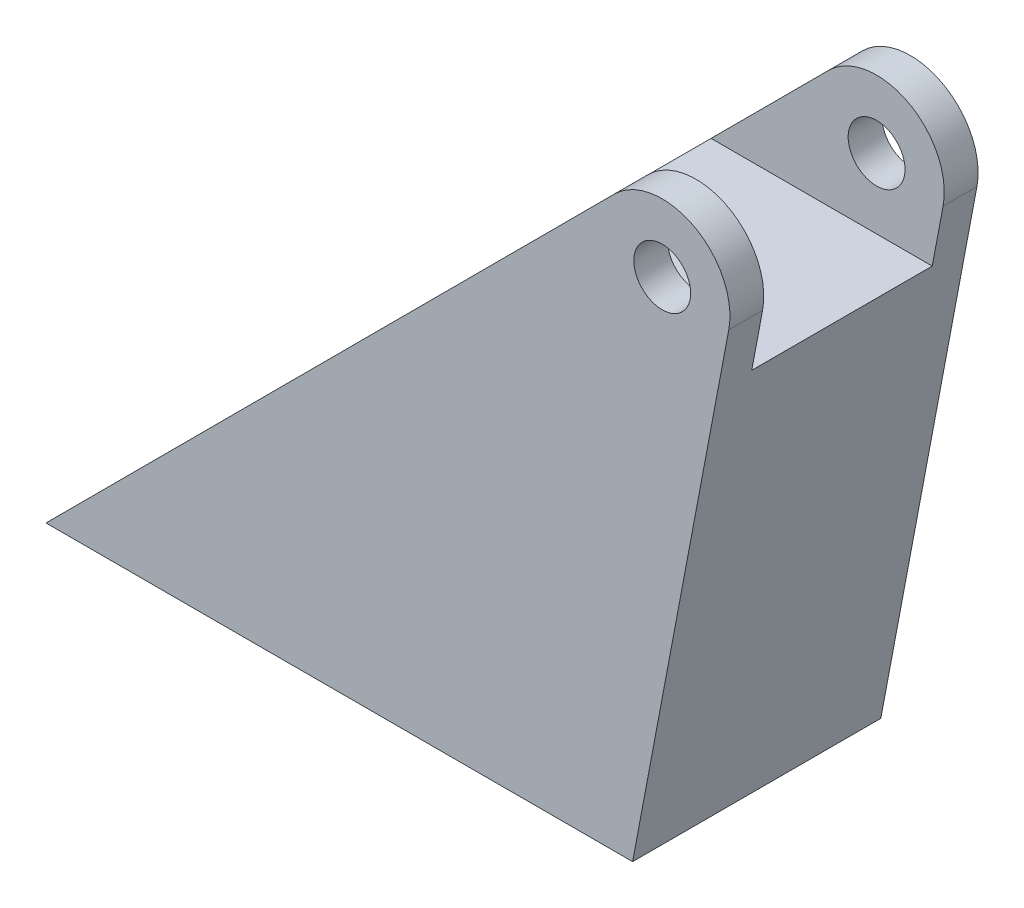
ISO-10303-21;
HEADER;
FILE_DESCRIPTION(('STEP AP214'),'2;1');
FILE_NAME('part.step','',(''),(''),'','','');
FILE_SCHEMA(('AUTOMOTIVE_DESIGN { 1 0 10303 214 1 1 1 1 }'));
ENDSEC;
DATA;
#1=APPLICATION_CONTEXT('core data for automotive mechanical design processes');
#2=APPLICATION_PROTOCOL_DEFINITION('international standard','automotive_design',2000,#1);
#3=PRODUCT_CONTEXT('',#1,'mechanical');
#4=PRODUCT('Part','Part','',(#3));
#5=PRODUCT_RELATED_PRODUCT_CATEGORY('part','',(#4));
#6=PRODUCT_DEFINITION_FORMATION('','',#4);
#7=PRODUCT_DEFINITION_CONTEXT('part definition',#1,'design');
#8=PRODUCT_DEFINITION('design','',#6,#7);
#9=PRODUCT_DEFINITION_SHAPE('','',#8);
#10=(LENGTH_UNIT() NAMED_UNIT(*) SI_UNIT(.MILLI.,.METRE.));
#11=(NAMED_UNIT(*) PLANE_ANGLE_UNIT() SI_UNIT($,.RADIAN.));
#12=(NAMED_UNIT(*) SI_UNIT($,.STERADIAN.) SOLID_ANGLE_UNIT());
#13=UNCERTAINTY_MEASURE_WITH_UNIT(LENGTH_MEASURE(1.E-05),#10,'distance_accuracy_value','');
#14=(GEOMETRIC_REPRESENTATION_CONTEXT(3) GLOBAL_UNCERTAINTY_ASSIGNED_CONTEXT((#13)) GLOBAL_UNIT_ASSIGNED_CONTEXT((#10,
#11,#12)) REPRESENTATION_CONTEXT('',''));
#15=CARTESIAN_POINT('',(0.,0.,0.));
#16=DIRECTION('',(0.,0.,1.));
#17=DIRECTION('',(1.,0.,0.));
#18=AXIS2_PLACEMENT_3D('',#15,#16,#17);
#19=CARTESIAN_POINT('',(4.16611869461281,92.3902344014633,0.));
#20=DIRECTION('',(0.,0.,1.));
#21=DIRECTION('',(1.,0.,0.));
#22=AXIS2_PLACEMENT_3D('',#19,#20,#21);
#23=PLANE('',#22);
#24=CARTESIAN_POINT('',(4.16611869461281,92.3902344014633,0.));
#25=DIRECTION('',(0.,0.,1.));
#26=DIRECTION('',(1.,0.,0.));
#27=AXIS2_PLACEMENT_3D('',#24,#25,#26);
#28=CIRCLE('',#27,4.00000000000001);
#29=CARTESIAN_POINT('',(8.16611869461282,92.3902344014633,0.));
#30=VERTEX_POINT('',#29);
#31=EDGE_CURVE('E93',#30,#30,#28,.T.);
#32=ORIENTED_EDGE('',*,*,#31,.T.);
#33=EDGE_LOOP('',(#32));
#34=FACE_BOUND('',#33,.T.);
#35=DIRECTION('',(1.,0.,0.));
#36=VECTOR('',#35,1.);
#37=CARTESIAN_POINT('',(-82.55,19.05,0.));
#38=LINE('',#37,#36);
#39=CARTESIAN_POINT('',(-82.55,19.05,0.));
#40=VERTEX_POINT('',#39);
#41=CARTESIAN_POINT('',(0.,19.05,0.));
#42=VERTEX_POINT('',#41);
#43=EDGE_CURVE('E105',#40,#42,#38,.T.);
#44=ORIENTED_EDGE('',*,*,#43,.F.);
#45=DIRECTION('',(-0.70668916022688,-0.707524155642637,0.));
#46=VECTOR('',#45,1.);
#47=CARTESIAN_POINT('',(-82.55,19.05,0.));
#48=LINE('',#47,#46);
#49=CARTESIAN_POINT('',(-2.57304888788332,99.1214486526243,0.));
#50=VERTEX_POINT('',#49);
#51=EDGE_CURVE('E81',#50,#40,#48,.T.);
#52=ORIENTED_EDGE('',*,*,#51,.F.);
#53=CARTESIAN_POINT('',(4.16611869461281,92.3902344014633,0.));
#54=DIRECTION('',(0.,0.,1.));
#55=DIRECTION('',(1.,0.,0.));
#56=AXIS2_PLACEMENT_3D('',#53,#54,#55);
#57=CIRCLE('',#56,9.52500000000001);
#58=CARTESIAN_POINT('',(13.5254606994384,90.6215223738264,0.));
#59=VERTEX_POINT('',#58);
#60=EDGE_CURVE('E86',#59,#50,#57,.T.);
#61=ORIENTED_EDGE('',*,*,#60,.F.);
#62=DIRECTION('',(0.185691551457944,0.982608084496124,0.));
#63=VECTOR('',#62,1.);
#64=CARTESIAN_POINT('',(0.,19.05,0.));
#65=LINE('',#64,#63);
#66=EDGE_CURVE('E68',#42,#59,#65,.T.);
#67=ORIENTED_EDGE('',*,*,#66,.F.);
#68=EDGE_LOOP('',(#44,#52,#61,#67));
#69=FACE_BOUND('',#68,.T.);
#70=ADVANCED_FACE('F34',(#34,#69),#23,.F.);
#71=CARTESIAN_POINT('',(4.16611869461281,92.3902344014633,34.925));
#72=DIRECTION('',(0.,0.,1.));
#73=DIRECTION('',(1.,0.,0.));
#74=AXIS2_PLACEMENT_3D('',#71,#72,#73);
#75=PLANE('',#74);
#76=CARTESIAN_POINT('',(4.16611869461281,92.3902344014633,34.925));
#77=DIRECTION('',(0.,0.,1.));
#78=DIRECTION('',(1.,0.,0.));
#79=AXIS2_PLACEMENT_3D('',#76,#77,#78);
#80=CIRCLE('',#79,4.00000000000001);
#81=CARTESIAN_POINT('',(8.16611869461282,92.3902344014633,34.925));
#82=VERTEX_POINT('',#81);
#83=EDGE_CURVE('E153',#82,#82,#80,.T.);
#84=ORIENTED_EDGE('',*,*,#83,.F.);
#85=EDGE_LOOP('',(#84));
#86=FACE_BOUND('',#85,.T.);
#87=DIRECTION('',(0.70668916022688,0.707524155642637,0.));
#88=VECTOR('',#87,1.);
#89=CARTESIAN_POINT('',(-50.8487334230164,50.7887235152745,34.925));
#90=LINE('',#89,#88);
#91=CARTESIAN_POINT('',(-82.55,19.05,34.925));
#92=VERTEX_POINT('',#91);
#93=CARTESIAN_POINT('',(-2.5730488878833,99.1214486526243,34.925));
#94=VERTEX_POINT('',#93);
#95=EDGE_CURVE('E146',#92,#94,#90,.T.);
#96=ORIENTED_EDGE('',*,*,#95,.F.);
#97=DIRECTION('',(-1.,0.,0.));
#98=VECTOR('',#97,1.);
#99=CARTESIAN_POINT('',(0.,19.05,34.925));
#100=LINE('',#99,#98);
#101=CARTESIAN_POINT('',(0.,19.05,34.925));
#102=VERTEX_POINT('',#101);
#103=EDGE_CURVE('E108',#102,#92,#100,.T.);
#104=ORIENTED_EDGE('',*,*,#103,.F.);
#105=DIRECTION('',(-0.185691551457944,-0.982608084496124,0.));
#106=VECTOR('',#105,1.);
#107=CARTESIAN_POINT('',(-3.47590147500313,0.656869760988449,34.925));
#108=LINE('',#107,#106);
#109=CARTESIAN_POINT('',(13.5254606994384,90.6215223738264,34.925));
#110=VERTEX_POINT('',#109);
#111=EDGE_CURVE('E140',#110,#102,#108,.T.);
#112=ORIENTED_EDGE('',*,*,#111,.F.);
#113=CARTESIAN_POINT('',(4.16611869461281,92.3902344014633,34.925));
#114=DIRECTION('',(0.,0.,1.));
#115=DIRECTION('',(1.,0.,0.));
#116=AXIS2_PLACEMENT_3D('',#113,#114,#115);
#117=CIRCLE('',#116,9.52500000000001);
#118=EDGE_CURVE('E155',#110,#94,#117,.T.);
#119=ORIENTED_EDGE('',*,*,#118,.T.);
#120=EDGE_LOOP('',(#96,#104,#112,#119));
#121=FACE_BOUND('',#120,.T.);
#122=ADVANCED_FACE('F223',(#86,#121),#75,.T.);
#123=CARTESIAN_POINT('',(4.16611869461281,92.3902344014633,4.7625));
#124=DIRECTION('',(0.,0.,1.));
#125=DIRECTION('',(1.,0.,0.));
#126=AXIS2_PLACEMENT_3D('',#123,#124,#125);
#127=PLANE('',#126);
#128=DIRECTION('',(-1.,0.,0.));
#129=VECTOR('',#128,1.);
#130=CARTESIAN_POINT('',(-19.1249404928125,82.55,4.7625));
#131=LINE('',#130,#129);
#132=CARTESIAN_POINT('',(12.0001185657108,82.55,4.7625));
#133=VERTEX_POINT('',#132);
#134=CARTESIAN_POINT('',(-19.1249404928125,82.55,4.7625));
#135=VERTEX_POINT('',#134);
#136=EDGE_CURVE('E49',#133,#135,#131,.T.);
#137=ORIENTED_EDGE('',*,*,#136,.F.);
#138=DIRECTION('',(0.185691551457944,0.982608084496124,0.));
#139=VECTOR('',#138,1.);
#140=CARTESIAN_POINT('',(0.,19.05,4.7625));
#141=LINE('',#140,#139);
#142=CARTESIAN_POINT('',(13.5254606994384,90.6215223738264,4.7625));
#143=VERTEX_POINT('',#142);
#144=EDGE_CURVE('E54',#133,#143,#141,.T.);
#145=ORIENTED_EDGE('',*,*,#144,.T.);
#146=CARTESIAN_POINT('',(4.16611869461281,92.3902344014633,4.7625));
#147=DIRECTION('',(0.,0.,1.));
#148=DIRECTION('',(1.,0.,0.));
#149=AXIS2_PLACEMENT_3D('',#146,#147,#148);
#150=CIRCLE('',#149,9.52500000000001);
#151=CARTESIAN_POINT('',(-2.57304888788332,99.1214486526243,4.7625));
#152=VERTEX_POINT('',#151);
#153=EDGE_CURVE('E80',#143,#152,#150,.T.);
#154=ORIENTED_EDGE('',*,*,#153,.T.);
#155=DIRECTION('',(-0.70668916022688,-0.707524155642637,0.));
#156=VECTOR('',#155,1.);
#157=CARTESIAN_POINT('',(-82.55,19.05,4.7625));
#158=LINE('',#157,#156);
#159=EDGE_CURVE('E117',#152,#135,#158,.T.);
#160=ORIENTED_EDGE('',*,*,#159,.T.);
#161=EDGE_LOOP('',(#137,#145,#154,#160));
#162=FACE_BOUND('',#161,.T.);
#163=CARTESIAN_POINT('',(4.16611869461281,92.3902344014633,4.7625));
#164=DIRECTION('',(0.,0.,1.));
#165=DIRECTION('',(1.,0.,0.));
#166=AXIS2_PLACEMENT_3D('',#163,#164,#165);
#167=CIRCLE('',#166,4.00000000000001);
#168=CARTESIAN_POINT('',(8.16611869461282,92.3902344014633,4.7625));
#169=VERTEX_POINT('',#168);
#170=EDGE_CURVE('E89',#169,#169,#167,.T.);
#171=ORIENTED_EDGE('',*,*,#170,.F.);
#172=EDGE_LOOP('',(#171));
#173=FACE_BOUND('',#172,.T.);
#174=ADVANCED_FACE('F122',(#162,#173),#127,.T.);
#175=CARTESIAN_POINT('',(4.16611869461281,92.3902344014633,4.7625));
#176=DIRECTION('',(0.,0.,-1.));
#177=DIRECTION('',(-1.,0.,0.));
#178=AXIS2_PLACEMENT_3D('',#175,#176,#177);
#179=CYLINDRICAL_SURFACE('',#178,9.52500000000001);
#180=ORIENTED_EDGE('',*,*,#60,.T.);
#181=DIRECTION('',(0.,0.,-1.));
#182=VECTOR('',#181,1.);
#183=CARTESIAN_POINT('',(-2.57304888788332,99.1214486526243,4.7625));
#184=LINE('',#183,#182);
#185=EDGE_CURVE('E11',#152,#50,#184,.T.);
#186=ORIENTED_EDGE('',*,*,#185,.F.);
#187=ORIENTED_EDGE('',*,*,#153,.F.);
#188=DIRECTION('',(0.,0.,-1.));
#189=VECTOR('',#188,1.);
#190=CARTESIAN_POINT('',(13.5254606994384,90.6215223738264,4.7625));
#191=LINE('',#190,#189);
#192=EDGE_CURVE('E71',#143,#59,#191,.T.);
#193=ORIENTED_EDGE('',*,*,#192,.T.);
#194=EDGE_LOOP('',(#180,#186,#187,#193));
#195=FACE_BOUND('',#194,.T.);
#196=ADVANCED_FACE('F36',(#195),#179,.T.);
#197=CARTESIAN_POINT('',(-82.55,19.05,4.7625));
#198=DIRECTION('',(0.707524155642637,-0.70668916022688,0.));
#199=DIRECTION('',(0.70668916022688,0.707524155642637,0.));
#200=AXIS2_PLACEMENT_3D('',#197,#198,#199);
#201=PLANE('',#200);
#202=CARTESIAN_POINT('',(-73.025,28.5862543559215,9.525));
#203=DIRECTION('',(0.707524155642637,-0.70668916022688,0.));
#204=DIRECTION('',(-0.70668916022688,-0.707524155642637,0.));
#205=AXIS2_PLACEMENT_3D('',#202,#203,#204);
#206=ELLIPSE('',#205,4.61857940335767,3.26389999999999);
#207=CARTESIAN_POINT('',(-76.2889,25.3184978632924,9.525));
#208=VERTEX_POINT('',#207);
#209=EDGE_CURVE('E113',#208,#208,#206,.T.);
#210=ORIENTED_EDGE('',*,*,#209,.T.);
#211=EDGE_LOOP('',(#210));
#212=FACE_BOUND('',#211,.T.);
#213=CARTESIAN_POINT('',(-73.025,28.5862543559215,28.575));
#214=DIRECTION('',(0.707524155642637,-0.70668916022688,0.));
#215=DIRECTION('',(-0.70668916022688,-0.707524155642637,0.));
#216=AXIS2_PLACEMENT_3D('',#213,#214,#215);
#217=ELLIPSE('',#216,4.61857940335767,3.26389999999999);
#218=CARTESIAN_POINT('',(-76.2889,25.3184978632924,28.575));
#219=VERTEX_POINT('',#218);
#220=EDGE_CURVE('E167',#219,#219,#217,.T.);
#221=ORIENTED_EDGE('',*,*,#220,.T.);
#222=EDGE_LOOP('',(#221));
#223=FACE_BOUND('',#222,.T.);
#224=CARTESIAN_POINT('',(-73.025,28.5862543559215,19.05));
#225=DIRECTION('',(0.707524155642637,-0.70668916022688,0.));
#226=DIRECTION('',(-0.70668916022688,-0.707524155642637,0.));
#227=AXIS2_PLACEMENT_3D('',#224,#225,#226);
#228=ELLIPSE('',#227,4.61857940335767,3.2639);
#229=CARTESIAN_POINT('',(-76.2889,25.3184978632924,19.05));
#230=VERTEX_POINT('',#229);
#231=EDGE_CURVE('E170',#230,#230,#228,.T.);
#232=ORIENTED_EDGE('',*,*,#231,.T.);
#233=EDGE_LOOP('',(#232));
#234=FACE_BOUND('',#233,.T.);
#235=ORIENTED_EDGE('',*,*,#51,.T.);
#236=DIRECTION('',(0.,0.,-1.));
#237=VECTOR('',#236,1.);
#238=CARTESIAN_POINT('',(-82.55,19.05,4.7625));
#239=LINE('',#238,#237);
#240=EDGE_CURVE('E42',#92,#40,#239,.T.);
#241=ORIENTED_EDGE('',*,*,#240,.F.);
#242=ORIENTED_EDGE('',*,*,#95,.T.);
#243=DIRECTION('',(0.,0.,-1.));
#244=VECTOR('',#243,1.);
#245=CARTESIAN_POINT('',(-2.5730488878833,99.1214486526243,34.925));
#246=LINE('',#245,#244);
#247=CARTESIAN_POINT('',(-2.5730488878833,99.1214486526243,30.1625));
#248=VERTEX_POINT('',#247);
#249=EDGE_CURVE('E137',#94,#248,#246,.T.);
#250=ORIENTED_EDGE('',*,*,#249,.T.);
#251=DIRECTION('',(0.70668916022688,0.707524155642637,0.));
#252=VECTOR('',#251,1.);
#253=CARTESIAN_POINT('',(-50.8487334230164,50.7887235152745,30.1625));
#254=LINE('',#253,#252);
#255=CARTESIAN_POINT('',(-19.1249404928125,82.55,30.1625));
#256=VERTEX_POINT('',#255);
#257=EDGE_CURVE('E150',#256,#248,#254,.T.);
#258=ORIENTED_EDGE('',*,*,#257,.F.);
#259=DIRECTION('',(0.,0.,-1.));
#260=VECTOR('',#259,1.);
#261=CARTESIAN_POINT('',(-19.1249404928125,82.55,30.1625));
#262=LINE('',#261,#260);
#263=EDGE_CURVE('E121',#256,#135,#262,.T.);
#264=ORIENTED_EDGE('',*,*,#263,.T.);
#265=ORIENTED_EDGE('',*,*,#159,.F.);
#266=ORIENTED_EDGE('',*,*,#185,.T.);
#267=EDGE_LOOP('',(#235,#241,#242,#250,#258,#264,#265,#266));
#268=FACE_BOUND('',#267,.T.);
#269=ADVANCED_FACE('F115',(#212,#223,#234,#268),#201,.F.);
#270=CARTESIAN_POINT('',(0.,19.05,4.7625));
#271=DIRECTION('',(-0.982608084496124,0.185691551457944,0.));
#272=DIRECTION('',(-0.185691551457944,-0.982608084496124,0.));
#273=AXIS2_PLACEMENT_3D('',#270,#271,#272);
#274=PLANE('',#273);
#275=ORIENTED_EDGE('',*,*,#66,.T.);
#276=ORIENTED_EDGE('',*,*,#192,.F.);
#277=ORIENTED_EDGE('',*,*,#144,.F.);
#278=DIRECTION('',(0.,0.,-1.));
#279=VECTOR('',#278,1.);
#280=CARTESIAN_POINT('',(12.0001185657108,82.55,30.1625));
#281=LINE('',#280,#279);
#282=CARTESIAN_POINT('',(12.0001185657108,82.55,30.1625));
#283=VERTEX_POINT('',#282);
#284=EDGE_CURVE('E127',#283,#133,#281,.T.);
#285=ORIENTED_EDGE('',*,*,#284,.F.);
#286=DIRECTION('',(-0.185691551457944,-0.982608084496124,0.));
#287=VECTOR('',#286,1.);
#288=CARTESIAN_POINT('',(-3.47590147500313,0.656869760988449,30.1625));
#289=LINE('',#288,#287);
#290=CARTESIAN_POINT('',(13.5254606994384,90.6215223738264,30.1625));
#291=VERTEX_POINT('',#290);
#292=EDGE_CURVE('E143',#291,#283,#289,.T.);
#293=ORIENTED_EDGE('',*,*,#292,.F.);
#294=DIRECTION('',(0.,0.,-1.));
#295=VECTOR('',#294,1.);
#296=CARTESIAN_POINT('',(13.5254606994384,90.6215223738264,34.925));
#297=LINE('',#296,#295);
#298=EDGE_CURVE('E134',#110,#291,#297,.T.);
#299=ORIENTED_EDGE('',*,*,#298,.F.);
#300=ORIENTED_EDGE('',*,*,#111,.T.);
#301=DIRECTION('',(0.,0.,-1.));
#302=VECTOR('',#301,1.);
#303=CARTESIAN_POINT('',(0.,19.05,4.7625));
#304=LINE('',#303,#302);
#305=EDGE_CURVE('E76',#102,#42,#304,.T.);
#306=ORIENTED_EDGE('',*,*,#305,.T.);
#307=EDGE_LOOP('',(#275,#276,#277,#285,#293,#299,#300,#306));
#308=FACE_BOUND('',#307,.T.);
#309=ADVANCED_FACE('F70',(#308),#274,.F.);
#310=CARTESIAN_POINT('',(4.16611869461281,92.3902344014633,4.7625));
#311=DIRECTION('',(0.,0.,-1.));
#312=DIRECTION('',(-1.,0.,0.));
#313=AXIS2_PLACEMENT_3D('',#310,#311,#312);
#314=CYLINDRICAL_SURFACE('',#313,4.00000000000001);
#315=ORIENTED_EDGE('',*,*,#170,.T.);
#316=EDGE_LOOP('',(#315));
#317=FACE_BOUND('',#316,.T.);
#318=ORIENTED_EDGE('',*,*,#31,.F.);
#319=EDGE_LOOP('',(#318));
#320=FACE_BOUND('',#319,.T.);
#321=ADVANCED_FACE('F235',(#317,#320),#314,.F.);
#322=CARTESIAN_POINT('',(-19.1249404928125,82.55,30.1625));
#323=DIRECTION('',(0.,-1.,0.));
#324=DIRECTION('',(0.,0.,-1.));
#325=AXIS2_PLACEMENT_3D('',#322,#323,#324);
#326=PLANE('',#325);
#327=ORIENTED_EDGE('',*,*,#136,.T.);
#328=ORIENTED_EDGE('',*,*,#263,.F.);
#329=DIRECTION('',(-1.,0.,0.));
#330=VECTOR('',#329,1.);
#331=CARTESIAN_POINT('',(-19.1249404928125,82.55,30.1625));
#332=LINE('',#331,#330);
#333=EDGE_CURVE('E132',#283,#256,#332,.T.);
#334=ORIENTED_EDGE('',*,*,#333,.F.);
#335=ORIENTED_EDGE('',*,*,#284,.T.);
#336=EDGE_LOOP('',(#327,#328,#334,#335));
#337=FACE_BOUND('',#336,.T.);
#338=ADVANCED_FACE('F366',(#337),#326,.F.);
#339=CARTESIAN_POINT('',(4.16611869461281,92.3902344014633,30.1625));
#340=DIRECTION('',(0.,0.,1.));
#341=DIRECTION('',(1.,0.,0.));
#342=AXIS2_PLACEMENT_3D('',#339,#340,#341);
#343=PLANE('',#342);
#344=CARTESIAN_POINT('',(4.16611869461281,92.3902344014633,30.1625));
#345=DIRECTION('',(0.,0.,1.));
#346=DIRECTION('',(1.,0.,0.));
#347=AXIS2_PLACEMENT_3D('',#344,#345,#346);
#348=CIRCLE('',#347,4.00000000000001);
#349=CARTESIAN_POINT('',(8.16611869461282,92.3902344014633,30.1625));
#350=VERTEX_POINT('',#349);
#351=EDGE_CURVE('E159',#350,#350,#348,.T.);
#352=ORIENTED_EDGE('',*,*,#351,.T.);
#353=EDGE_LOOP('',(#352));
#354=FACE_BOUND('',#353,.T.);
#355=ORIENTED_EDGE('',*,*,#292,.T.);
#356=ORIENTED_EDGE('',*,*,#333,.T.);
#357=ORIENTED_EDGE('',*,*,#257,.T.);
#358=CARTESIAN_POINT('',(4.16611869461281,92.3902344014633,30.1625));
#359=DIRECTION('',(0.,0.,1.));
#360=DIRECTION('',(1.,0.,0.));
#361=AXIS2_PLACEMENT_3D('',#358,#359,#360);
#362=CIRCLE('',#361,9.52500000000001);
#363=EDGE_CURVE('E147',#291,#248,#362,.T.);
#364=ORIENTED_EDGE('',*,*,#363,.F.);
#365=EDGE_LOOP('',(#355,#356,#357,#364));
#366=FACE_BOUND('',#365,.T.);
#367=ADVANCED_FACE('F357',(#354,#366),#343,.F.);
#368=CARTESIAN_POINT('',(4.16611869461281,92.3902344014633,34.925));
#369=DIRECTION('',(0.,0.,-1.));
#370=DIRECTION('',(-1.,0.,0.));
#371=AXIS2_PLACEMENT_3D('',#368,#369,#370);
#372=CYLINDRICAL_SURFACE('',#371,9.52500000000001);
#373=ORIENTED_EDGE('',*,*,#363,.T.);
#374=ORIENTED_EDGE('',*,*,#249,.F.);
#375=ORIENTED_EDGE('',*,*,#118,.F.);
#376=ORIENTED_EDGE('',*,*,#298,.T.);
#377=EDGE_LOOP('',(#373,#374,#375,#376));
#378=FACE_BOUND('',#377,.T.);
#379=ADVANCED_FACE('F348',(#378),#372,.T.);
#380=CARTESIAN_POINT('',(4.16611869461281,92.3902344014633,34.925));
#381=DIRECTION('',(0.,0.,-1.));
#382=DIRECTION('',(-1.,0.,0.));
#383=AXIS2_PLACEMENT_3D('',#380,#381,#382);
#384=CYLINDRICAL_SURFACE('',#383,4.00000000000001);
#385=ORIENTED_EDGE('',*,*,#83,.T.);
#386=EDGE_LOOP('',(#385));
#387=FACE_BOUND('',#386,.T.);
#388=ORIENTED_EDGE('',*,*,#351,.F.);
#389=EDGE_LOOP('',(#388));
#390=FACE_BOUND('',#389,.T.);
#391=ADVANCED_FACE('F207',(#387,#390),#384,.F.);
#392=CARTESIAN_POINT('',(0.,19.05,0.));
#393=DIRECTION('',(0.,-1.,0.));
#394=DIRECTION('',(0.,0.,-1.));
#395=AXIS2_PLACEMENT_3D('',#392,#393,#394);
#396=PLANE('',#395);
#397=CARTESIAN_POINT('',(-73.025,19.05,9.525));
#398=DIRECTION('',(0.,-1.,0.));
#399=DIRECTION('',(0.,0.,-1.));
#400=AXIS2_PLACEMENT_3D('',#397,#398,#399);
#401=CIRCLE('',#400,3.26389999999999);
#402=CARTESIAN_POINT('',(-73.025,19.05,6.2611));
#403=VERTEX_POINT('',#402);
#404=EDGE_CURVE('E177',#403,#403,#401,.T.);
#405=ORIENTED_EDGE('',*,*,#404,.F.);
#406=EDGE_LOOP('',(#405));
#407=FACE_BOUND('',#406,.T.);
#408=CARTESIAN_POINT('',(-73.025,19.05,28.575));
#409=DIRECTION('',(0.,-1.,0.));
#410=DIRECTION('',(0.,0.,1.));
#411=AXIS2_PLACEMENT_3D('',#408,#409,#410);
#412=CIRCLE('',#411,3.26389999999999);
#413=CARTESIAN_POINT('',(-73.025,19.05,31.8389));
#414=VERTEX_POINT('',#413);
#415=EDGE_CURVE('E193',#414,#414,#412,.T.);
#416=ORIENTED_EDGE('',*,*,#415,.F.);
#417=EDGE_LOOP('',(#416));
#418=FACE_BOUND('',#417,.T.);
#419=CARTESIAN_POINT('',(-9.525,19.05,28.575));
#420=DIRECTION('',(0.,-1.,0.));
#421=DIRECTION('',(0.,0.,1.));
#422=AXIS2_PLACEMENT_3D('',#419,#420,#421);
#423=CIRCLE('',#422,3.2639);
#424=CARTESIAN_POINT('',(-9.525,19.05,31.8389));
#425=VERTEX_POINT('',#424);
#426=EDGE_CURVE('E187',#425,#425,#423,.T.);
#427=ORIENTED_EDGE('',*,*,#426,.F.);
#428=EDGE_LOOP('',(#427));
#429=FACE_BOUND('',#428,.T.);
#430=CARTESIAN_POINT('',(-9.525,19.05,19.05));
#431=DIRECTION('',(0.,-1.,0.));
#432=DIRECTION('',(0.,0.,-1.));
#433=AXIS2_PLACEMENT_3D('',#430,#431,#432);
#434=CIRCLE('',#433,3.2639);
#435=CARTESIAN_POINT('',(-9.525,19.05,15.7861));
#436=VERTEX_POINT('',#435);
#437=EDGE_CURVE('E180',#436,#436,#434,.T.);
#438=ORIENTED_EDGE('',*,*,#437,.F.);
#439=EDGE_LOOP('',(#438));
#440=FACE_BOUND('',#439,.T.);
#441=CARTESIAN_POINT('',(-73.025,19.05,19.05));
#442=DIRECTION('',(0.,-1.,0.));
#443=DIRECTION('',(0.,0.,-1.));
#444=AXIS2_PLACEMENT_3D('',#441,#442,#443);
#445=CIRCLE('',#444,3.2639);
#446=CARTESIAN_POINT('',(-73.025,19.05,15.7861));
#447=VERTEX_POINT('',#446);
#448=EDGE_CURVE('E184',#447,#447,#445,.T.);
#449=ORIENTED_EDGE('',*,*,#448,.F.);
#450=EDGE_LOOP('',(#449));
#451=FACE_BOUND('',#450,.T.);
#452=CARTESIAN_POINT('',(-9.525,19.05,9.52500000000001));
#453=DIRECTION('',(0.,-1.,0.));
#454=DIRECTION('',(0.,0.,-1.));
#455=AXIS2_PLACEMENT_3D('',#452,#453,#454);
#456=CIRCLE('',#455,3.2639);
#457=CARTESIAN_POINT('',(-9.525,19.05,6.26110000000001));
#458=VERTEX_POINT('',#457);
#459=EDGE_CURVE('E174',#458,#458,#456,.T.);
#460=ORIENTED_EDGE('',*,*,#459,.F.);
#461=EDGE_LOOP('',(#460));
#462=FACE_BOUND('',#461,.T.);
#463=ORIENTED_EDGE('',*,*,#240,.T.);
#464=ORIENTED_EDGE('',*,*,#43,.T.);
#465=ORIENTED_EDGE('',*,*,#305,.F.);
#466=ORIENTED_EDGE('',*,*,#103,.T.);
#467=EDGE_LOOP('',(#463,#464,#465,#466));
#468=FACE_BOUND('',#467,.T.);
#469=ADVANCED_FACE('F104',(#407,#418,#429,#440,#451,#462,#468),#396,.T.);
#470=CARTESIAN_POINT('',(-9.525,50.8,9.52500000000001));
#471=DIRECTION('',(0.,-1.,0.));
#472=DIRECTION('',(0.,0.,-1.));
#473=AXIS2_PLACEMENT_3D('',#470,#471,#472);
#474=CYLINDRICAL_SURFACE('',#473,3.2639);
#475=CARTESIAN_POINT('',(-9.525,50.8,9.52500000000001));
#476=DIRECTION('',(0.,-1.,0.));
#477=DIRECTION('',(0.,0.,-1.));
#478=AXIS2_PLACEMENT_3D('',#475,#476,#477);
#479=CIRCLE('',#478,3.2639);
#480=CARTESIAN_POINT('',(-9.525,50.8,6.26110000000001));
#481=VERTEX_POINT('',#480);
#482=EDGE_CURVE('E173',#481,#481,#479,.T.);
#483=ORIENTED_EDGE('',*,*,#482,.F.);
#484=EDGE_LOOP('',(#483));
#485=FACE_BOUND('',#484,.T.);
#486=ORIENTED_EDGE('',*,*,#459,.T.);
#487=EDGE_LOOP('',(#486));
#488=FACE_BOUND('',#487,.T.);
#489=ADVANCED_FACE('F206',(#485,#488),#474,.F.);
#490=CARTESIAN_POINT('',(-9.525,50.8,9.52500000000001));
#491=DIRECTION('',(0.,-1.,0.));
#492=DIRECTION('',(0.,0.,-1.));
#493=AXIS2_PLACEMENT_3D('',#490,#491,#492);
#494=PLANE('',#493);
#495=ORIENTED_EDGE('',*,*,#482,.T.);
#496=EDGE_LOOP('',(#495));
#497=FACE_BOUND('',#496,.T.);
#498=ADVANCED_FACE('F213',(#497),#494,.T.);
#499=CARTESIAN_POINT('',(-73.025,50.8,19.05));
#500=DIRECTION('',(0.,-1.,0.));
#501=DIRECTION('',(0.,0.,-1.));
#502=AXIS2_PLACEMENT_3D('',#499,#500,#501);
#503=CYLINDRICAL_SURFACE('',#502,3.2639);
#504=ORIENTED_EDGE('',*,*,#448,.T.);
#505=EDGE_LOOP('',(#504));
#506=FACE_BOUND('',#505,.T.);
#507=ORIENTED_EDGE('',*,*,#231,.F.);
#508=EDGE_LOOP('',(#507));
#509=FACE_BOUND('',#508,.T.);
#510=ADVANCED_FACE('F201',(#506,#509),#503,.F.);
#511=CARTESIAN_POINT('',(-9.525,50.8,19.05));
#512=DIRECTION('',(0.,-1.,0.));
#513=DIRECTION('',(0.,0.,-1.));
#514=AXIS2_PLACEMENT_3D('',#511,#512,#513);
#515=CYLINDRICAL_SURFACE('',#514,3.2639);
#516=CARTESIAN_POINT('',(-9.525,50.8,19.05));
#517=DIRECTION('',(0.,-1.,0.));
#518=DIRECTION('',(0.,0.,-1.));
#519=AXIS2_PLACEMENT_3D('',#516,#517,#518);
#520=CIRCLE('',#519,3.2639);
#521=CARTESIAN_POINT('',(-9.525,50.8,15.7861));
#522=VERTEX_POINT('',#521);
#523=EDGE_CURVE('E183',#522,#522,#520,.T.);
#524=ORIENTED_EDGE('',*,*,#523,.F.);
#525=EDGE_LOOP('',(#524));
#526=FACE_BOUND('',#525,.T.);
#527=ORIENTED_EDGE('',*,*,#437,.T.);
#528=EDGE_LOOP('',(#527));
#529=FACE_BOUND('',#528,.T.);
#530=ADVANCED_FACE('F247',(#526,#529),#515,.F.);
#531=CARTESIAN_POINT('',(-9.525,50.8,19.05));
#532=DIRECTION('',(0.,-1.,0.));
#533=DIRECTION('',(0.,0.,-1.));
#534=AXIS2_PLACEMENT_3D('',#531,#532,#533);
#535=PLANE('',#534);
#536=ORIENTED_EDGE('',*,*,#523,.T.);
#537=EDGE_LOOP('',(#536));
#538=FACE_BOUND('',#537,.T.);
#539=ADVANCED_FACE('F252',(#538),#535,.T.);
#540=CARTESIAN_POINT('',(-9.525,50.8,28.575));
#541=DIRECTION('',(0.,-1.,0.));
#542=DIRECTION('',(0.,0.,-1.));
#543=AXIS2_PLACEMENT_3D('',#540,#541,#542);
#544=CYLINDRICAL_SURFACE('',#543,3.2639);
#545=CARTESIAN_POINT('',(-9.525,50.8,28.575));
#546=DIRECTION('',(0.,-1.,0.));
#547=DIRECTION('',(0.,0.,1.));
#548=AXIS2_PLACEMENT_3D('',#545,#546,#547);
#549=CIRCLE('',#548,3.2639);
#550=CARTESIAN_POINT('',(-9.525,50.8,31.8389));
#551=VERTEX_POINT('',#550);
#552=EDGE_CURVE('E190',#551,#551,#549,.T.);
#553=ORIENTED_EDGE('',*,*,#552,.F.);
#554=EDGE_LOOP('',(#553));
#555=FACE_BOUND('',#554,.T.);
#556=ORIENTED_EDGE('',*,*,#426,.T.);
#557=EDGE_LOOP('',(#556));
#558=FACE_BOUND('',#557,.T.);
#559=ADVANCED_FACE('F267',(#555,#558),#544,.F.);
#560=CARTESIAN_POINT('',(-9.525,50.8,28.575));
#561=DIRECTION('',(0.,1.,0.));
#562=DIRECTION('',(0.,0.,1.));
#563=AXIS2_PLACEMENT_3D('',#560,#561,#562);
#564=PLANE('',#563);
#565=ORIENTED_EDGE('',*,*,#552,.T.);
#566=EDGE_LOOP('',(#565));
#567=FACE_BOUND('',#566,.T.);
#568=ADVANCED_FACE('F263',(#567),#564,.F.);
#569=CARTESIAN_POINT('',(-73.025,50.8,28.575));
#570=DIRECTION('',(0.,-1.,0.));
#571=DIRECTION('',(0.,0.,-1.));
#572=AXIS2_PLACEMENT_3D('',#569,#570,#571);
#573=CYLINDRICAL_SURFACE('',#572,3.26389999999999);
#574=ORIENTED_EDGE('',*,*,#415,.T.);
#575=EDGE_LOOP('',(#574));
#576=FACE_BOUND('',#575,.T.);
#577=ORIENTED_EDGE('',*,*,#220,.F.);
#578=EDGE_LOOP('',(#577));
#579=FACE_BOUND('',#578,.T.);
#580=ADVANCED_FACE('F259',(#576,#579),#573,.F.);
#581=CARTESIAN_POINT('',(-73.025,50.8,9.525));
#582=DIRECTION('',(0.,-1.,0.));
#583=DIRECTION('',(0.,0.,-1.));
#584=AXIS2_PLACEMENT_3D('',#581,#582,#583);
#585=CYLINDRICAL_SURFACE('',#584,3.26389999999999);
#586=ORIENTED_EDGE('',*,*,#404,.T.);
#587=EDGE_LOOP('',(#586));
#588=FACE_BOUND('',#587,.T.);
#589=ORIENTED_EDGE('',*,*,#209,.F.);
#590=EDGE_LOOP('',(#589));
#591=FACE_BOUND('',#590,.T.);
#592=ADVANCED_FACE('F256',(#588,#591),#585,.F.);
#593=CLOSED_SHELL('',(#70,#122,#174,#196,#269,#309,#321,#338,#367,#379,#391,#469,#489,#498,#510,
#530,#539,#559,#568,#580,#592));
#594=MANIFOLD_SOLID_BREP('B2',#593);
#595=ADVANCED_BREP_SHAPE_REPRESENTATION('',(#18,#594),#14);
#596=SHAPE_DEFINITION_REPRESENTATION(#9,#595);
ENDSEC;
END-ISO-10303-21;
